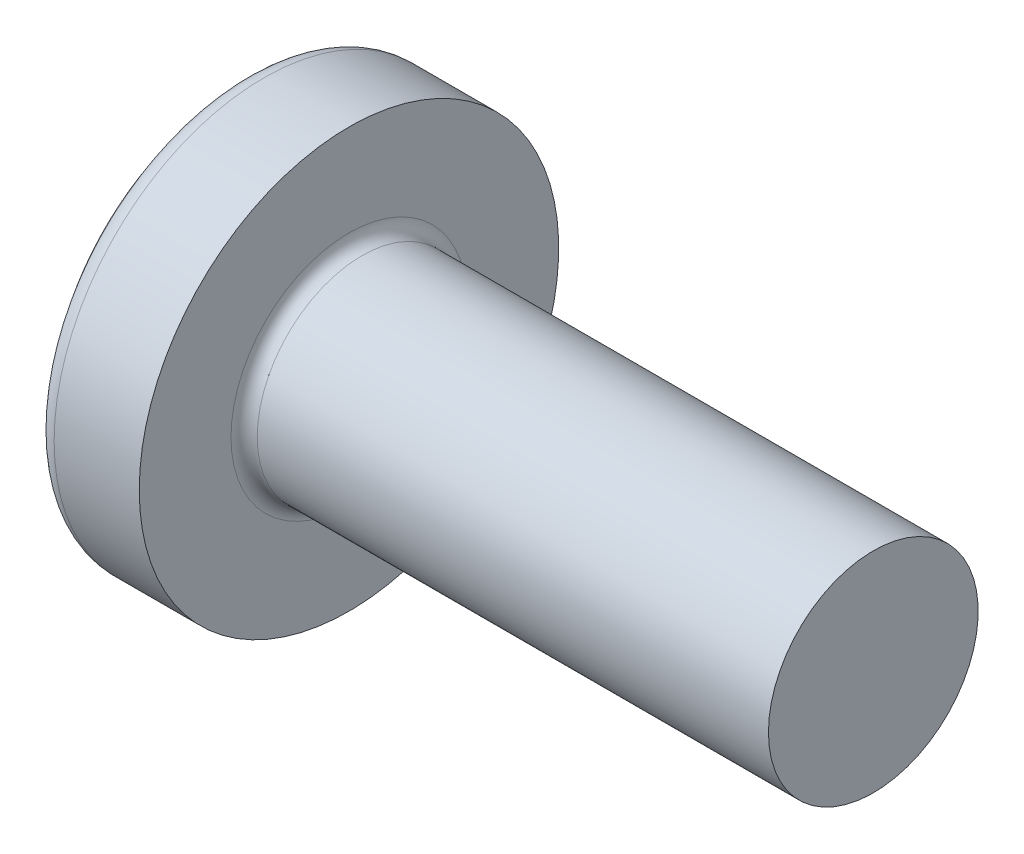
ISO-10303-21;
HEADER;
FILE_DESCRIPTION(('STEP AP214'),'2;1');
FILE_NAME('part.step','',(''),(''),'','','');
FILE_SCHEMA(('AUTOMOTIVE_DESIGN { 1 0 10303 214 1 1 1 1 }'));
ENDSEC;
DATA;
#1=APPLICATION_CONTEXT('core data for automotive mechanical design processes');
#2=APPLICATION_PROTOCOL_DEFINITION('international standard','automotive_design',2000,#1);
#3=PRODUCT_CONTEXT('',#1,'mechanical');
#4=PRODUCT('Part','Part','',(#3));
#5=PRODUCT_RELATED_PRODUCT_CATEGORY('part','',(#4));
#6=PRODUCT_DEFINITION_FORMATION('','',#4);
#7=PRODUCT_DEFINITION_CONTEXT('part definition',#1,'design');
#8=PRODUCT_DEFINITION('design','',#6,#7);
#9=PRODUCT_DEFINITION_SHAPE('','',#8);
#10=(LENGTH_UNIT() NAMED_UNIT(*) SI_UNIT(.MILLI.,.METRE.));
#11=(NAMED_UNIT(*) PLANE_ANGLE_UNIT() SI_UNIT($,.RADIAN.));
#12=(NAMED_UNIT(*) SI_UNIT($,.STERADIAN.) SOLID_ANGLE_UNIT());
#13=UNCERTAINTY_MEASURE_WITH_UNIT(LENGTH_MEASURE(1.E-05),#10,'distance_accuracy_value','');
#14=(GEOMETRIC_REPRESENTATION_CONTEXT(3) GLOBAL_UNCERTAINTY_ASSIGNED_CONTEXT((#13)) GLOBAL_UNIT_ASSIGNED_CONTEXT((#10,
#11,#12)) REPRESENTATION_CONTEXT('',''));
#15=CARTESIAN_POINT('',(0.,0.,0.));
#16=DIRECTION('',(0.,0.,1.));
#17=DIRECTION('',(1.,0.,0.));
#18=AXIS2_PLACEMENT_3D('',#15,#16,#17);
#19=CARTESIAN_POINT('',(2.5,0.,0.));
#20=DIRECTION('',(-1.,0.,0.));
#21=DIRECTION('',(0.,1.,0.));
#22=AXIS2_PLACEMENT_3D('',#19,#20,#21);
#23=SPHERICAL_SURFACE('',#22,2.5);
#24=CARTESIAN_POINT('',(0.532633828839689,0.,0.));
#25=DIRECTION('',(-1.,0.,0.));
#26=DIRECTION('',(0.,0.,1.));
#27=AXIS2_PLACEMENT_3D('',#24,#25,#26);
#28=CIRCLE('',#27,1.54255319148936);
#29=CARTESIAN_POINT('',(0.532633828839689,0.,1.54255319148936));
#30=VERTEX_POINT('',#29);
#31=EDGE_CURVE('E241',#30,#30,#28,.T.);
#32=ORIENTED_EDGE('',*,*,#31,.T.);
#33=EDGE_LOOP('',(#32));
#34=FACE_BOUND('',#33,.T.);
#35=CARTESIAN_POINT('',(0.0348536438778153,0.,0.));
#36=DIRECTION('',(1.,0.,0.));
#37=DIRECTION('',(0.,0.,-1.));
#38=AXIS2_PLACEMENT_3D('',#35,#36,#37);
#39=CIRCLE('',#38,0.415996926548163);
#40=CARTESIAN_POINT('',(0.0348536438778156,-0.239999999999999,-0.339784406495528));
#41=VERTEX_POINT('',#40);
#42=CARTESIAN_POINT('',(0.0348536438778153,-0.339784406495526,-0.24));
#43=VERTEX_POINT('',#42);
#44=EDGE_CURVE('E377',#41,#43,#39,.F.);
#45=ORIENTED_EDGE('',*,*,#44,.F.);
#46=CARTESIAN_POINT('',(2.5,-0.24,0.));
#47=DIRECTION('',(0.,1.,0.));
#48=DIRECTION('',(0.,0.,1.));
#49=AXIS2_PLACEMENT_3D('',#46,#47,#48);
#50=CIRCLE('',#49,2.48845333490504);
#51=CARTESIAN_POINT('',(0.12361367782094,-0.239999999999997,-0.738368504041365));
#52=VERTEX_POINT('',#51);
#53=EDGE_CURVE('E303',#52,#41,#50,.T.);
#54=ORIENTED_EDGE('',*,*,#53,.F.);
#55=CARTESIAN_POINT('',(2.32172308413752,0.,0.357568235162189));
#56=DIRECTION('',(0.446197753347436,0.,-0.894934391398443));
#57=DIRECTION('',(-0.894934391398443,0.,-0.446197753347436));
#58=AXIS2_PLACEMENT_3D('',#55,#56,#57);
#59=CIRCLE('',#58,2.46786594013402);
#60=CARTESIAN_POINT('',(0.12361367782094,0.240000000000003,-0.738368504041363));
#61=VERTEX_POINT('',#60);
#62=EDGE_CURVE('E275',#52,#61,#59,.T.);
#63=ORIENTED_EDGE('',*,*,#62,.T.);
#64=CARTESIAN_POINT('',(2.5,0.24,0.));
#65=DIRECTION('',(0.,-1.,0.));
#66=DIRECTION('',(0.,0.,-1.));
#67=AXIS2_PLACEMENT_3D('',#64,#65,#66);
#68=CIRCLE('',#67,2.48845333490504);
#69=CARTESIAN_POINT('',(0.0348536438778155,0.240000000000001,-0.339784406495526));
#70=VERTEX_POINT('',#69);
#71=EDGE_CURVE('E330',#70,#61,#68,.T.);
#72=ORIENTED_EDGE('',*,*,#71,.F.);
#73=CARTESIAN_POINT('',(0.0348536438778153,0.339784406495525,-0.24));
#74=VERTEX_POINT('',#73);
#75=EDGE_CURVE('E396',#74,#70,#39,.F.);
#76=ORIENTED_EDGE('',*,*,#75,.F.);
#77=CARTESIAN_POINT('',(2.5,0.,-0.24));
#78=DIRECTION('',(0.,0.,1.));
#79=DIRECTION('',(1.,0.,0.));
#80=AXIS2_PLACEMENT_3D('',#77,#78,#79);
#81=CIRCLE('',#80,2.48845333490504);
#82=CARTESIAN_POINT('',(0.12361367782094,0.738368504041364,-0.24));
#83=VERTEX_POINT('',#82);
#84=EDGE_CURVE('E269',#83,#74,#81,.T.);
#85=ORIENTED_EDGE('',*,*,#84,.F.);
#86=CARTESIAN_POINT('',(2.32172308413752,-0.357568235162189,0.));
#87=DIRECTION('',(0.446197753347436,0.894934391398443,0.));
#88=DIRECTION('',(-0.894934391398443,0.446197753347436,0.));
#89=AXIS2_PLACEMENT_3D('',#86,#87,#88);
#90=CIRCLE('',#89,2.46786594013402);
#91=CARTESIAN_POINT('',(0.12361367782094,0.738368504041364,0.24));
#92=VERTEX_POINT('',#91);
#93=EDGE_CURVE('E272',#83,#92,#90,.T.);
#94=ORIENTED_EDGE('',*,*,#93,.T.);
#95=CARTESIAN_POINT('',(2.5,0.,0.24));
#96=DIRECTION('',(0.,0.,-1.));
#97=DIRECTION('',(0.,1.,0.));
#98=AXIS2_PLACEMENT_3D('',#95,#96,#97);
#99=CIRCLE('',#98,2.48845333490504);
#100=CARTESIAN_POINT('',(0.0348536438778153,0.339784406495525,0.24));
#101=VERTEX_POINT('',#100);
#102=EDGE_CURVE('E265',#101,#92,#99,.T.);
#103=ORIENTED_EDGE('',*,*,#102,.F.);
#104=CARTESIAN_POINT('',(0.0348536438778156,0.239999999999999,0.339784406495528));
#105=VERTEX_POINT('',#104);
#106=EDGE_CURVE('E395',#105,#101,#39,.F.);
#107=ORIENTED_EDGE('',*,*,#106,.F.);
#108=CARTESIAN_POINT('',(0.12361367782094,0.239999999999997,0.738368504041365));
#109=VERTEX_POINT('',#108);
#110=EDGE_CURVE('E285',#109,#105,#68,.T.);
#111=ORIENTED_EDGE('',*,*,#110,.F.);
#112=CARTESIAN_POINT('',(2.32172308413752,0.,-0.357568235162189));
#113=DIRECTION('',(0.446197753347436,0.,0.894934391398443));
#114=DIRECTION('',(0.894934391398443,0.,-0.446197753347436));
#115=AXIS2_PLACEMENT_3D('',#112,#113,#114);
#116=CIRCLE('',#115,2.46786594013402);
#117=CARTESIAN_POINT('',(0.12361367782094,-0.240000000000002,0.738368504041363));
#118=VERTEX_POINT('',#117);
#119=EDGE_CURVE('E52',#109,#118,#116,.T.);
#120=ORIENTED_EDGE('',*,*,#119,.T.);
#121=CARTESIAN_POINT('',(0.0348536438778154,-0.240000000000001,0.339784406495526));
#122=VERTEX_POINT('',#121);
#123=EDGE_CURVE('E282',#122,#118,#50,.T.);
#124=ORIENTED_EDGE('',*,*,#123,.F.);
#125=CARTESIAN_POINT('',(0.0348536438778153,-0.339784406495526,0.24));
#126=VERTEX_POINT('',#125);
#127=EDGE_CURVE('E435',#126,#122,#39,.F.);
#128=ORIENTED_EDGE('',*,*,#127,.F.);
#129=CARTESIAN_POINT('',(0.12361367782094,-0.738368504041364,0.24));
#130=VERTEX_POINT('',#129);
#131=EDGE_CURVE('E266',#130,#126,#99,.T.);
#132=ORIENTED_EDGE('',*,*,#131,.F.);
#133=CARTESIAN_POINT('',(2.32172308413752,0.357568235162189,0.));
#134=DIRECTION('',(0.446197753347436,-0.894934391398443,0.));
#135=DIRECTION('',(0.894934391398443,0.446197753347436,0.));
#136=AXIS2_PLACEMENT_3D('',#133,#134,#135);
#137=CIRCLE('',#136,2.46786594013402);
#138=CARTESIAN_POINT('',(0.12361367782094,-0.738368504041364,-0.24));
#139=VERTEX_POINT('',#138);
#140=EDGE_CURVE('E262',#130,#139,#137,.T.);
#141=ORIENTED_EDGE('',*,*,#140,.T.);
#142=EDGE_CURVE('E67',#43,#139,#81,.T.);
#143=ORIENTED_EDGE('',*,*,#142,.F.);
#144=EDGE_LOOP('',(#45,#54,#63,#72,#76,#85,#94,#103,#107,#111,#120,#124,#128,#132,#141,#143));
#145=FACE_BOUND('',#144,.T.);
#146=ADVANCED_FACE('F38',(#34,#145),#23,.T.);
#147=CARTESIAN_POINT('',(0.,0.8,-0.24));
#148=DIRECTION('',(0.,0.,1.));
#149=DIRECTION('',(1.,0.,0.));
#150=AXIS2_PLACEMENT_3D('',#147,#148,#149);
#151=PLANE('',#150);
#152=ORIENTED_EDGE('',*,*,#84,.T.);
#153=CARTESIAN_POINT('',(-0.629305626090504,0.395285037112982,-0.24));
#154=CARTESIAN_POINT('',(-0.502245440869323,0.384885761504805,-0.24));
#155=CARTESIAN_POINT('',(-0.375193303991233,0.374386041200533,-0.24));
#156=CARTESIAN_POINT('',(-0.121109362358297,0.353102592236972,-0.24));
#157=CARTESIAN_POINT('',(0.00592244174753981,0.342318855839852,-0.24));
#158=CARTESIAN_POINT('',(0.259954553132912,0.320384813741064,-0.24));
#159=CARTESIAN_POINT('',(0.386954860411928,0.309234508033358,-0.24));
#160=CARTESIAN_POINT('',(0.640908035068628,0.286428502217992,-0.24));
#161=CARTESIAN_POINT('',(0.767860903211904,0.274772810656204,-0.24));
#162=CARTESIAN_POINT('',(1.02740505364566,0.25019581365541,-0.24));
#163=CARTESIAN_POINT('',(1.15999322223084,0.23724116727319,-0.24));
#164=CARTESIAN_POINT('',(1.35878055743683,0.216851377657761,-0.24));
#165=CARTESIAN_POINT('',(1.42502853887615,0.209894992147932,-0.24));
#166=CARTESIAN_POINT('',(1.55747716895954,0.195536747895868,-0.24));
#167=CARTESIAN_POINT('',(1.62367781680678,0.18813488182494,-0.24));
#168=CARTESIAN_POINT('',(1.68984631429487,0.180447253558898,-0.24));
#169=B_SPLINE_CURVE_WITH_KNOTS('',3,(#153,#154,#155,#156,#157,#158,#159,#160,#161,#162,#163,
#164,#165,#166,#167,#168),.UNSPECIFIED.,.F.,.F.,(4,2,2,2,2,2,2,4),(0.,0.382455333743982,
0.764921098031735,1.14738686861956,1.52984617438513,1.92950045825533,2.12933578679647,
2.32917440376968),.UNSPECIFIED.);
#170=CARTESIAN_POINT('',(0.9,0.262259890185289,-0.24));
#171=VERTEX_POINT('',#170);
#172=EDGE_CURVE('E419',#74,#171,#169,.T.);
#173=ORIENTED_EDGE('',*,*,#172,.T.);
#174=DIRECTION('',(0.,1.,0.));
#175=VECTOR('',#174,1.);
#176=CARTESIAN_POINT('',(0.9,-0.351276627792593,-0.24));
#177=LINE('',#176,#175);
#178=CARTESIAN_POINT('',(0.9,0.351276627792593,-0.24));
#179=VERTEX_POINT('',#178);
#180=EDGE_CURVE('E359',#171,#179,#177,.T.);
#181=ORIENTED_EDGE('',*,*,#180,.T.);
#182=DIRECTION('',(0.894934391398443,-0.446197753347436,0.));
#183=VECTOR('',#182,1.);
#184=CARTESIAN_POINT('',(0.,0.8,-0.24));
#185=LINE('',#184,#183);
#186=EDGE_CURVE('E242',#83,#179,#185,.T.);
#187=ORIENTED_EDGE('',*,*,#186,.F.);
#188=EDGE_LOOP('',(#152,#173,#181,#187));
#189=FACE_BOUND('',#188,.T.);
#190=ADVANCED_FACE('F197',(#189),#151,.T.);
#191=CARTESIAN_POINT('',(0.9,-0.351276627792593,-0.24));
#192=VERTEX_POINT('',#191);
#193=CARTESIAN_POINT('',(0.9,-0.262259890185289,-0.24));
#194=VERTEX_POINT('',#193);
#195=EDGE_CURVE('E250',#192,#194,#177,.T.);
#196=ORIENTED_EDGE('',*,*,#195,.T.);
#197=CARTESIAN_POINT('',(-0.629305626090504,-0.395285037112982,-0.24));
#198=CARTESIAN_POINT('',(-0.502245440869323,-0.384885761504805,-0.24));
#199=CARTESIAN_POINT('',(-0.375193303991233,-0.374386041200533,-0.24));
#200=CARTESIAN_POINT('',(-0.121109362358296,-0.353102592236972,-0.24));
#201=CARTESIAN_POINT('',(0.00592244174753997,-0.342318855839852,-0.24));
#202=CARTESIAN_POINT('',(0.259954553132912,-0.320384813741064,-0.24));
#203=CARTESIAN_POINT('',(0.386954860411928,-0.309234508033358,-0.24));
#204=CARTESIAN_POINT('',(0.640908035068629,-0.286428502217992,-0.24));
#205=CARTESIAN_POINT('',(0.767860903211904,-0.274772810656204,-0.24));
#206=CARTESIAN_POINT('',(1.02740505364565,-0.250195813655411,-0.24));
#207=CARTESIAN_POINT('',(1.15999322223082,-0.237241167273191,-0.24));
#208=CARTESIAN_POINT('',(1.35878055743681,-0.216851377657763,-0.24));
#209=CARTESIAN_POINT('',(1.42502853887612,-0.209894992147935,-0.24));
#210=CARTESIAN_POINT('',(1.55747716895951,-0.195536747895872,-0.24));
#211=CARTESIAN_POINT('',(1.62367781680675,-0.188134881824944,-0.24));
#212=CARTESIAN_POINT('',(1.68984631429483,-0.180447253558903,-0.24));
#213=B_SPLINE_CURVE_WITH_KNOTS('',3,(#197,#198,#199,#200,#201,#202,#203,#204,#205,#206,#207,
#208,#209,#210,#211,#212),.UNSPECIFIED.,.F.,.F.,(4,2,2,2,2,2,2,4),(0.,0.382455333743982,
0.764921098031735,1.14738686861956,1.52984617438513,1.92950045825531,2.12933578679643,
2.32917440376964),.UNSPECIFIED.);
#214=EDGE_CURVE('E394',#194,#43,#213,.F.);
#215=ORIENTED_EDGE('',*,*,#214,.T.);
#216=ORIENTED_EDGE('',*,*,#142,.T.);
#217=DIRECTION('',(0.894934391398443,0.446197753347436,0.));
#218=VECTOR('',#217,1.);
#219=CARTESIAN_POINT('',(0.,-0.8,-0.24));
#220=LINE('',#219,#218);
#221=EDGE_CURVE('E333',#139,#192,#220,.T.);
#222=ORIENTED_EDGE('',*,*,#221,.T.);
#223=EDGE_LOOP('',(#196,#215,#216,#222));
#224=FACE_BOUND('',#223,.T.);
#225=ADVANCED_FACE('F203',(#224),#151,.T.);
#226=CARTESIAN_POINT('',(0.,-0.799999999999999,0.24));
#227=DIRECTION('',(0.,0.,-1.));
#228=DIRECTION('',(0.,1.,0.));
#229=AXIS2_PLACEMENT_3D('',#226,#227,#228);
#230=PLANE('',#229);
#231=DIRECTION('',(0.,-1.,0.));
#232=VECTOR('',#231,1.);
#233=CARTESIAN_POINT('',(0.9,0.351276627792594,0.24));
#234=LINE('',#233,#232);
#235=CARTESIAN_POINT('',(0.9,0.351276627792593,0.24));
#236=VERTEX_POINT('',#235);
#237=CARTESIAN_POINT('',(0.9,0.262259890185289,0.24));
#238=VERTEX_POINT('',#237);
#239=EDGE_CURVE('E342',#236,#238,#234,.T.);
#240=ORIENTED_EDGE('',*,*,#239,.T.);
#241=CARTESIAN_POINT('',(-0.629305630567792,0.395285037479254,0.24));
#242=CARTESIAN_POINT('',(-0.502245444906562,0.384885761837513,0.24));
#243=CARTESIAN_POINT('',(-0.37519330758842,0.374386041499476,0.24));
#244=CARTESIAN_POINT('',(-0.121109365075988,0.353102592467066,0.24));
#245=CARTESIAN_POINT('',(0.00592243946929239,0.342318856034865,0.24));
#246=CARTESIAN_POINT('',(0.259954552394605,0.320384813806507,0.24));
#247=CARTESIAN_POINT('',(0.386954860773954,0.309234508002403,0.24));
#248=CARTESIAN_POINT('',(0.640908037631127,0.28642850198631,0.24));
#249=CARTESIAN_POINT('',(0.767860906874543,0.274772810320191,0.24));
#250=CARTESIAN_POINT('',(1.02740503497565,0.250195815411899,0.24));
#251=CARTESIAN_POINT('',(1.15999318014164,0.237241171372315,0.24));
#252=CARTESIAN_POINT('',(1.35878048026026,0.216851385682782,0.24));
#253=CARTESIAN_POINT('',(1.42502845000982,0.209895001550346,0.24));
#254=CARTESIAN_POINT('',(1.55747705673949,0.195536760284768,0.24));
#255=CARTESIAN_POINT('',(1.62367769292276,0.188134895822942,0.24));
#256=CARTESIAN_POINT('',(1.68984617876648,0.180447269328966,0.24));
#257=B_SPLINE_CURVE_WITH_KNOTS('',3,(#241,#242,#243,#244,#245,#246,#247,#248,#249,#250,#251,
#252,#253,#254,#255,#256),.UNSPECIFIED.,.F.,.F.,(4,2,2,2,2,2,2,4),(0.,0.382455335067977,
0.764921100678223,1.14738687457974,1.52984618366023,1.92950039692501,2.12933569015818,
2.32917427182042),.UNSPECIFIED.);
#258=EDGE_CURVE('E674',#238,#101,#257,.F.);
#259=ORIENTED_EDGE('',*,*,#258,.T.);
#260=ORIENTED_EDGE('',*,*,#102,.T.);
#261=DIRECTION('',(0.894934391398443,-0.446197753347436,0.));
#262=VECTOR('',#261,1.);
#263=CARTESIAN_POINT('',(0.,0.8,0.24));
#264=LINE('',#263,#262);
#265=EDGE_CURVE('E247',#92,#236,#264,.T.);
#266=ORIENTED_EDGE('',*,*,#265,.T.);
#267=EDGE_LOOP('',(#240,#259,#260,#266));
#268=FACE_BOUND('',#267,.T.);
#269=ADVANCED_FACE('F415',(#268),#230,.T.);
#270=ORIENTED_EDGE('',*,*,#131,.T.);
#271=CARTESIAN_POINT('',(-0.629305630567792,-0.395285037479254,0.24));
#272=CARTESIAN_POINT('',(-0.502245444906562,-0.384885761837513,0.24));
#273=CARTESIAN_POINT('',(-0.37519330758842,-0.374386041499476,0.24));
#274=CARTESIAN_POINT('',(-0.121109365075988,-0.353102592467066,0.24));
#275=CARTESIAN_POINT('',(0.00592243946929239,-0.342318856034865,0.24));
#276=CARTESIAN_POINT('',(0.259954552394605,-0.320384813806507,0.24));
#277=CARTESIAN_POINT('',(0.386954860773954,-0.309234508002403,0.24));
#278=CARTESIAN_POINT('',(0.640908037631127,-0.28642850198631,0.24));
#279=CARTESIAN_POINT('',(0.767860906874543,-0.274772810320191,0.24));
#280=CARTESIAN_POINT('',(1.02740503497565,-0.250195815411899,0.24));
#281=CARTESIAN_POINT('',(1.15999318014165,-0.237241171372315,0.24));
#282=CARTESIAN_POINT('',(1.35878048026027,-0.216851385682782,0.24));
#283=CARTESIAN_POINT('',(1.42502845000983,-0.209895001550345,0.24));
#284=CARTESIAN_POINT('',(1.55747705673949,-0.195536760284768,0.24));
#285=CARTESIAN_POINT('',(1.62367769292277,-0.188134895822941,0.24));
#286=CARTESIAN_POINT('',(1.68984617876649,-0.180447269328966,0.24));
#287=B_SPLINE_CURVE_WITH_KNOTS('',3,(#271,#272,#273,#274,#275,#276,#277,#278,#279,#280,#281,
#282,#283,#284,#285,#286),.UNSPECIFIED.,.F.,.F.,(4,2,2,2,2,2,2,4),(0.,0.382455335067977,
0.764921100678223,1.14738687457974,1.52984618366023,1.92950039692501,2.12933569015818,
2.32917427182042),.UNSPECIFIED.);
#288=CARTESIAN_POINT('',(0.9,-0.262259890185289,0.24));
#289=VERTEX_POINT('',#288);
#290=EDGE_CURVE('E436',#126,#289,#287,.T.);
#291=ORIENTED_EDGE('',*,*,#290,.T.);
#292=CARTESIAN_POINT('',(0.9,-0.351276627792593,0.24));
#293=VERTEX_POINT('',#292);
#294=EDGE_CURVE('E344',#289,#293,#234,.T.);
#295=ORIENTED_EDGE('',*,*,#294,.T.);
#296=DIRECTION('',(0.894934391398443,0.446197753347436,0.));
#297=VECTOR('',#296,1.);
#298=CARTESIAN_POINT('',(0.,-0.8,0.24));
#299=LINE('',#298,#297);
#300=EDGE_CURVE('E335',#130,#293,#299,.T.);
#301=ORIENTED_EDGE('',*,*,#300,.F.);
#302=EDGE_LOOP('',(#270,#291,#295,#301));
#303=FACE_BOUND('',#302,.T.);
#304=ADVANCED_FACE('F522',(#303),#230,.T.);
#305=CARTESIAN_POINT('',(0.9,0.351276627792594,0.24));
#306=DIRECTION('',(0.446197753347436,0.894934391398443,0.));
#307=DIRECTION('',(-0.894934391398443,0.446197753347436,0.));
#308=AXIS2_PLACEMENT_3D('',#305,#306,#307);
#309=PLANE('',#308);
#310=CARTESIAN_POINT('',(1.51667990224654,0.0438114218941496,0.));
#311=DIRECTION('',(0.446197753347436,0.894934391398443,0.));
#312=DIRECTION('',(-0.894934391398443,0.446197753347436,0.));
#313=AXIS2_PLACEMENT_3D('',#310,#311,#312);
#314=ELLIPSE('',#313,0.700087658673246,0.309289972496479);
#315=CARTESIAN_POINT('',(0.9,0.351276627792594,0.0546349775021752));
#316=VERTEX_POINT('',#315);
#317=CARTESIAN_POINT('',(0.9,0.351276627792594,-0.0546349775021753));
#318=VERTEX_POINT('',#317);
#319=EDGE_CURVE('E308',#316,#318,#314,.F.);
#320=ORIENTED_EDGE('',*,*,#319,.F.);
#321=DIRECTION('',(0.,0.,-1.));
#322=VECTOR('',#321,1.);
#323=CARTESIAN_POINT('',(0.9,0.351276627792594,0.24));
#324=LINE('',#323,#322);
#325=EDGE_CURVE('E345',#236,#316,#324,.T.);
#326=ORIENTED_EDGE('',*,*,#325,.F.);
#327=ORIENTED_EDGE('',*,*,#265,.F.);
#328=ORIENTED_EDGE('',*,*,#93,.F.);
#329=ORIENTED_EDGE('',*,*,#186,.T.);
#330=EDGE_CURVE('E347',#318,#179,#324,.T.);
#331=ORIENTED_EDGE('',*,*,#330,.F.);
#332=EDGE_LOOP('',(#320,#326,#327,#328,#329,#331));
#333=FACE_BOUND('',#332,.T.);
#334=ADVANCED_FACE('F413',(#333),#309,.F.);
#335=CARTESIAN_POINT('',(0.9,-0.351276627792593,-0.24));
#336=DIRECTION('',(0.446197753347436,-0.894934391398443,0.));
#337=DIRECTION('',(0.894934391398443,0.446197753347436,0.));
#338=AXIS2_PLACEMENT_3D('',#335,#336,#337);
#339=PLANE('',#338);
#340=CARTESIAN_POINT('',(1.51667990224654,-0.0438114218941494,0.));
#341=DIRECTION('',(0.446197753347436,-0.894934391398443,0.));
#342=DIRECTION('',(-0.894934391398443,-0.446197753347436,0.));
#343=AXIS2_PLACEMENT_3D('',#340,#341,#342);
#344=ELLIPSE('',#343,0.700087658673246,0.30928997249648);
#345=CARTESIAN_POINT('',(0.9,-0.351276627792594,-0.054634977502177));
#346=VERTEX_POINT('',#345);
#347=CARTESIAN_POINT('',(0.9,-0.351276627792594,0.0546349775021769));
#348=VERTEX_POINT('',#347);
#349=EDGE_CURVE('E676',#346,#348,#344,.F.);
#350=ORIENTED_EDGE('',*,*,#349,.F.);
#351=DIRECTION('',(0.,0.,1.));
#352=VECTOR('',#351,1.);
#353=CARTESIAN_POINT('',(0.9,-0.351276627792593,-0.24));
#354=LINE('',#353,#352);
#355=EDGE_CURVE('E338',#192,#346,#354,.T.);
#356=ORIENTED_EDGE('',*,*,#355,.F.);
#357=ORIENTED_EDGE('',*,*,#221,.F.);
#358=ORIENTED_EDGE('',*,*,#140,.F.);
#359=ORIENTED_EDGE('',*,*,#300,.T.);
#360=EDGE_CURVE('E341',#348,#293,#354,.T.);
#361=ORIENTED_EDGE('',*,*,#360,.F.);
#362=EDGE_LOOP('',(#350,#356,#357,#358,#359,#361));
#363=FACE_BOUND('',#362,.T.);
#364=ADVANCED_FACE('F509',(#363),#339,.F.);
#365=CARTESIAN_POINT('',(0.9,0.351276627792593,-0.24));
#366=DIRECTION('',(-1.,0.,0.));
#367=DIRECTION('',(0.,0.,1.));
#368=AXIS2_PLACEMENT_3D('',#365,#366,#367);
#369=PLANE('',#368);
#370=DIRECTION('',(0.,1.,0.));
#371=VECTOR('',#370,1.);
#372=CARTESIAN_POINT('',(0.9,-0.240000000000001,0.351276627792593));
#373=LINE('',#372,#371);
#374=CARTESIAN_POINT('',(0.9,-0.240000000000001,0.351276627792593));
#375=VERTEX_POINT('',#374);
#376=CARTESIAN_POINT('',(0.9,-0.0546349775021802,0.351276627792593));
#377=VERTEX_POINT('',#376);
#378=EDGE_CURVE('E323',#375,#377,#373,.T.);
#379=ORIENTED_EDGE('',*,*,#378,.T.);
#380=CARTESIAN_POINT('',(0.9,0.,0.));
#381=DIRECTION('',(-1.,0.,0.));
#382=DIRECTION('',(0.,0.,1.));
#383=AXIS2_PLACEMENT_3D('',#380,#381,#382);
#384=CIRCLE('',#383,0.3555);
#385=CARTESIAN_POINT('',(0.9,-0.240000000000001,0.262259890185289));
#386=VERTEX_POINT('',#385);
#387=EDGE_CURVE('E704',#386,#377,#384,.T.);
#388=ORIENTED_EDGE('',*,*,#387,.F.);
#389=DIRECTION('',(0.,0.,-1.));
#390=VECTOR('',#389,1.);
#391=CARTESIAN_POINT('',(0.9,-0.240000000000001,0.351276627792593));
#392=LINE('',#391,#390);
#393=EDGE_CURVE('E319',#375,#386,#392,.T.);
#394=ORIENTED_EDGE('',*,*,#393,.F.);
#395=EDGE_LOOP('',(#379,#388,#394));
#396=FACE_BOUND('',#395,.T.);
#397=ADVANCED_FACE('F502',(#396),#369,.T.);
#398=ORIENTED_EDGE('',*,*,#294,.F.);
#399=EDGE_CURVE('E709',#348,#289,#384,.T.);
#400=ORIENTED_EDGE('',*,*,#399,.F.);
#401=ORIENTED_EDGE('',*,*,#360,.T.);
#402=EDGE_LOOP('',(#398,#400,#401));
#403=FACE_BOUND('',#402,.T.);
#404=ADVANCED_FACE('F495',(#403),#369,.T.);
#405=ORIENTED_EDGE('',*,*,#355,.T.);
#406=EDGE_CURVE('E388',#194,#346,#384,.T.);
#407=ORIENTED_EDGE('',*,*,#406,.F.);
#408=ORIENTED_EDGE('',*,*,#195,.F.);
#409=EDGE_LOOP('',(#405,#407,#408));
#410=FACE_BOUND('',#409,.T.);
#411=ADVANCED_FACE('F489',(#410),#369,.T.);
#412=CARTESIAN_POINT('',(0.9,-0.239999999999999,-0.262259890185289));
#413=VERTEX_POINT('',#412);
#414=CARTESIAN_POINT('',(0.9,-0.239999999999999,-0.351276627792594));
#415=VERTEX_POINT('',#414);
#416=EDGE_CURVE('E322',#413,#415,#392,.T.);
#417=ORIENTED_EDGE('',*,*,#416,.F.);
#418=CARTESIAN_POINT('',(0.9,-0.0546349775021794,-0.351276627792594));
#419=VERTEX_POINT('',#418);
#420=EDGE_CURVE('E59',#419,#413,#384,.T.);
#421=ORIENTED_EDGE('',*,*,#420,.F.);
#422=DIRECTION('',(0.,-1.,0.));
#423=VECTOR('',#422,1.);
#424=CARTESIAN_POINT('',(0.9,0.240000000000001,-0.351276627792592));
#425=LINE('',#424,#423);
#426=EDGE_CURVE('E318',#419,#415,#425,.T.);
#427=ORIENTED_EDGE('',*,*,#426,.T.);
#428=EDGE_LOOP('',(#417,#421,#427));
#429=FACE_BOUND('',#428,.T.);
#430=ADVANCED_FACE('F383',(#429),#369,.T.);
#431=CARTESIAN_POINT('',(0.9,0.240000000000001,-0.351276627792592));
#432=VERTEX_POINT('',#431);
#433=CARTESIAN_POINT('',(0.9,0.054634977502182,-0.351276627792593));
#434=VERTEX_POINT('',#433);
#435=EDGE_CURVE('E315',#432,#434,#425,.T.);
#436=ORIENTED_EDGE('',*,*,#435,.T.);
#437=CARTESIAN_POINT('',(0.9,0.240000000000001,-0.262259890185289));
#438=VERTEX_POINT('',#437);
#439=EDGE_CURVE('E387',#438,#434,#384,.T.);
#440=ORIENTED_EDGE('',*,*,#439,.F.);
#441=DIRECTION('',(0.,0.,1.));
#442=VECTOR('',#441,1.);
#443=CARTESIAN_POINT('',(0.9,0.240000000000001,-0.351276627792592));
#444=LINE('',#443,#442);
#445=EDGE_CURVE('E327',#432,#438,#444,.T.);
#446=ORIENTED_EDGE('',*,*,#445,.F.);
#447=EDGE_LOOP('',(#436,#440,#446));
#448=FACE_BOUND('',#447,.T.);
#449=ADVANCED_FACE('F477',(#448),#369,.T.);
#450=ORIENTED_EDGE('',*,*,#180,.F.);
#451=EDGE_CURVE('E693',#318,#171,#384,.T.);
#452=ORIENTED_EDGE('',*,*,#451,.F.);
#453=ORIENTED_EDGE('',*,*,#330,.T.);
#454=EDGE_LOOP('',(#450,#452,#453));
#455=FACE_BOUND('',#454,.T.);
#456=ADVANCED_FACE('F470',(#455),#369,.T.);
#457=ORIENTED_EDGE('',*,*,#325,.T.);
#458=EDGE_CURVE('E695',#238,#316,#384,.T.);
#459=ORIENTED_EDGE('',*,*,#458,.F.);
#460=ORIENTED_EDGE('',*,*,#239,.F.);
#461=EDGE_LOOP('',(#457,#459,#460));
#462=FACE_BOUND('',#461,.T.);
#463=ADVANCED_FACE('F464',(#462),#369,.T.);
#464=CARTESIAN_POINT('',(0.,0.239999999999997,0.8));
#465=DIRECTION('',(0.,-1.,0.));
#466=DIRECTION('',(1.,0.,0.));
#467=AXIS2_PLACEMENT_3D('',#464,#465,#466);
#468=PLANE('',#467);
#469=ORIENTED_EDGE('',*,*,#110,.T.);
#470=CARTESIAN_POINT('',(-0.629305626090504,0.239999999999999,0.395285037112982));
#471=CARTESIAN_POINT('',(-0.502245440869323,0.239999999999999,0.384885761504806));
#472=CARTESIAN_POINT('',(-0.375193303991233,0.239999999999999,0.374386041200533));
#473=CARTESIAN_POINT('',(-0.121109362358296,0.239999999999999,0.353102592236972));
#474=CARTESIAN_POINT('',(0.00592244174753997,0.239999999999999,0.342318855839852));
#475=CARTESIAN_POINT('',(0.259954553132912,0.239999999999999,0.320384813741065));
#476=CARTESIAN_POINT('',(0.386954860411928,0.239999999999999,0.309234508033359));
#477=CARTESIAN_POINT('',(0.640908035068629,0.239999999999999,0.286428502217993));
#478=CARTESIAN_POINT('',(0.767860903211904,0.239999999999999,0.274772810656205));
#479=CARTESIAN_POINT('',(1.02740505364566,0.239999999999999,0.250195813655411));
#480=CARTESIAN_POINT('',(1.15999322223084,0.239999999999999,0.237241167273191));
#481=CARTESIAN_POINT('',(1.35878055743683,0.239999999999999,0.216851377657762));
#482=CARTESIAN_POINT('',(1.42502853887615,0.239999999999999,0.209894992147933));
#483=CARTESIAN_POINT('',(1.55747716895955,0.239999999999999,0.195536747895869));
#484=CARTESIAN_POINT('',(1.62367781680678,0.239999999999999,0.188134881824941));
#485=CARTESIAN_POINT('',(1.68984631429487,0.239999999999999,0.180447253558899));
#486=B_SPLINE_CURVE_WITH_KNOTS('',3,(#470,#471,#472,#473,#474,#475,#476,#477,#478,#479,#480,
#481,#482,#483,#484,#485),.UNSPECIFIED.,.F.,.F.,(4,2,2,2,2,2,2,4),(0.,0.382455333743982,
0.764921098031735,1.14738686861956,1.52984617438513,1.92950045825533,2.12933578679647,
2.32917440376968),.UNSPECIFIED.);
#487=CARTESIAN_POINT('',(0.9,0.239999999999999,0.26225989018529));
#488=VERTEX_POINT('',#487);
#489=EDGE_CURVE('E673',#105,#488,#486,.T.);
#490=ORIENTED_EDGE('',*,*,#489,.T.);
#491=CARTESIAN_POINT('',(0.9,0.239999999999999,0.351276627792594));
#492=VERTEX_POINT('',#491);
#493=EDGE_CURVE('E300',#488,#492,#444,.T.);
#494=ORIENTED_EDGE('',*,*,#493,.T.);
#495=DIRECTION('',(0.894934391398443,0.,-0.446197753347436));
#496=VECTOR('',#495,1.);
#497=CARTESIAN_POINT('',(0.,0.239999999999997,0.800000000000001));
#498=LINE('',#497,#496);
#499=EDGE_CURVE('E293',#109,#492,#498,.T.);
#500=ORIENTED_EDGE('',*,*,#499,.F.);
#501=EDGE_LOOP('',(#469,#490,#494,#500));
#502=FACE_BOUND('',#501,.T.);
#503=ADVANCED_FACE('F297',(#502),#468,.T.);
#504=CARTESIAN_POINT('',(0.,-0.239999999999997,-0.8));
#505=DIRECTION('',(0.,1.,0.));
#506=DIRECTION('',(0.,0.,1.));
#507=AXIS2_PLACEMENT_3D('',#504,#505,#506);
#508=PLANE('',#507);
#509=ORIENTED_EDGE('',*,*,#393,.T.);
#510=CARTESIAN_POINT('',(-0.629305630567792,-0.240000000000001,0.395285037479253));
#511=CARTESIAN_POINT('',(-0.502245444906562,-0.240000000000001,0.384885761837512));
#512=CARTESIAN_POINT('',(-0.375193307588421,-0.240000000000001,0.374386041499475));
#513=CARTESIAN_POINT('',(-0.121109365075988,-0.240000000000001,0.353102592467065));
#514=CARTESIAN_POINT('',(0.00592243946929229,-0.240000000000001,0.342318856034864));
#515=CARTESIAN_POINT('',(0.259954552394605,-0.240000000000001,0.320384813806506));
#516=CARTESIAN_POINT('',(0.386954860773954,-0.240000000000001,0.309234508002402));
#517=CARTESIAN_POINT('',(0.640908037631128,-0.240000000000001,0.286428501986309));
#518=CARTESIAN_POINT('',(0.767860906874543,-0.240000000000001,0.27477281032019));
#519=CARTESIAN_POINT('',(1.02740503497565,-0.240000000000001,0.250195815411898));
#520=CARTESIAN_POINT('',(1.15999318014165,-0.240000000000001,0.237241171372314));
#521=CARTESIAN_POINT('',(1.35878048026027,-0.240000000000001,0.216851385682781));
#522=CARTESIAN_POINT('',(1.42502845000983,-0.240000000000001,0.209895001550344));
#523=CARTESIAN_POINT('',(1.5574770567395,-0.240000000000001,0.195536760284766));
#524=CARTESIAN_POINT('',(1.62367769292277,-0.240000000000001,0.18813489582294));
#525=CARTESIAN_POINT('',(1.68984617876649,-0.240000000000001,0.180447269328964));
#526=B_SPLINE_CURVE_WITH_KNOTS('',3,(#510,#511,#512,#513,#514,#515,#516,#517,#518,#519,#520,
#521,#522,#523,#524,#525),.UNSPECIFIED.,.F.,.F.,(4,2,2,2,2,2,2,4),(0.,0.382455335067977,
0.764921100678223,1.14738687457974,1.52984618366023,1.92950039692502,2.12933569015819,
2.32917427182043),.UNSPECIFIED.);
#527=EDGE_CURVE('E428',#386,#122,#526,.F.);
#528=ORIENTED_EDGE('',*,*,#527,.T.);
#529=ORIENTED_EDGE('',*,*,#123,.T.);
#530=DIRECTION('',(0.894934391398443,0.,-0.446197753347436));
#531=VECTOR('',#530,1.);
#532=CARTESIAN_POINT('',(0.,-0.240000000000003,0.799999999999999));
#533=LINE('',#532,#531);
#534=EDGE_CURVE('E295',#118,#375,#533,.T.);
#535=ORIENTED_EDGE('',*,*,#534,.T.);
#536=EDGE_LOOP('',(#509,#528,#529,#535));
#537=FACE_BOUND('',#536,.T.);
#538=ADVANCED_FACE('F232',(#537),#508,.T.);
#539=CARTESIAN_POINT('',(0.9,-0.240000000000001,0.351276627792593));
#540=DIRECTION('',(0.446197753347436,0.,0.894934391398443));
#541=DIRECTION('',(-0.894934391398443,0.,0.446197753347436));
#542=AXIS2_PLACEMENT_3D('',#539,#540,#541);
#543=PLANE('',#542);
#544=CARTESIAN_POINT('',(1.51667990224654,0.,0.0438114218941495));
#545=DIRECTION('',(0.446197753347436,0.,0.894934391398443));
#546=DIRECTION('',(-0.894934391398443,0.,0.446197753347436));
#547=AXIS2_PLACEMENT_3D('',#544,#545,#546);
#548=ELLIPSE('',#547,0.700087658673246,0.30928997249648);
#549=CARTESIAN_POINT('',(0.9,0.0546349775021778,0.351276627792594));
#550=VERTEX_POINT('',#549);
#551=EDGE_CURVE('E426',#377,#550,#548,.F.);
#552=ORIENTED_EDGE('',*,*,#551,.F.);
#553=ORIENTED_EDGE('',*,*,#378,.F.);
#554=ORIENTED_EDGE('',*,*,#534,.F.);
#555=ORIENTED_EDGE('',*,*,#119,.F.);
#556=ORIENTED_EDGE('',*,*,#499,.T.);
#557=EDGE_CURVE('E326',#550,#492,#373,.T.);
#558=ORIENTED_EDGE('',*,*,#557,.F.);
#559=EDGE_LOOP('',(#552,#553,#554,#555,#556,#558));
#560=FACE_BOUND('',#559,.T.);
#561=ADVANCED_FACE('F291',(#560),#543,.F.);
#562=CARTESIAN_POINT('',(0.9,0.240000000000001,-0.351276627792592));
#563=DIRECTION('',(0.446197753347436,0.,-0.894934391398443));
#564=DIRECTION('',(0.894934391398443,0.,0.446197753347436));
#565=AXIS2_PLACEMENT_3D('',#562,#563,#564);
#566=PLANE('',#565);
#567=CARTESIAN_POINT('',(1.51667990224654,0.,-0.0438114218941494));
#568=DIRECTION('',(0.446197753347436,0.,-0.894934391398443));
#569=DIRECTION('',(-0.894934391398443,0.,-0.446197753347436));
#570=AXIS2_PLACEMENT_3D('',#567,#568,#569);
#571=ELLIPSE('',#570,0.700087658673246,0.30928997249648);
#572=EDGE_CURVE('E381',#434,#419,#571,.F.);
#573=ORIENTED_EDGE('',*,*,#572,.F.);
#574=ORIENTED_EDGE('',*,*,#435,.F.);
#575=DIRECTION('',(0.894934391398443,0.,0.446197753347436));
#576=VECTOR('',#575,1.);
#577=CARTESIAN_POINT('',(0.,0.240000000000003,-0.799999999999999));
#578=LINE('',#577,#576);
#579=EDGE_CURVE('E305',#61,#432,#578,.T.);
#580=ORIENTED_EDGE('',*,*,#579,.F.);
#581=ORIENTED_EDGE('',*,*,#62,.F.);
#582=DIRECTION('',(0.894934391398443,0.,0.446197753347436));
#583=VECTOR('',#582,1.);
#584=CARTESIAN_POINT('',(0.,-0.239999999999997,-0.800000000000001));
#585=LINE('',#584,#583);
#586=EDGE_CURVE('E312',#52,#415,#585,.T.);
#587=ORIENTED_EDGE('',*,*,#586,.T.);
#588=ORIENTED_EDGE('',*,*,#426,.F.);
#589=EDGE_LOOP('',(#573,#574,#580,#581,#587,#588));
#590=FACE_BOUND('',#589,.T.);
#591=ADVANCED_FACE('F372',(#590),#566,.F.);
#592=ORIENTED_EDGE('',*,*,#445,.T.);
#593=CARTESIAN_POINT('',(-0.629305630567792,0.240000000000001,-0.395285037479253));
#594=CARTESIAN_POINT('',(-0.502245444906562,0.240000000000001,-0.384885761837512));
#595=CARTESIAN_POINT('',(-0.37519330758842,0.240000000000001,-0.374386041499475));
#596=CARTESIAN_POINT('',(-0.121109365075988,0.240000000000001,-0.353102592467065));
#597=CARTESIAN_POINT('',(0.00592243946929239,0.240000000000001,-0.342318856034864));
#598=CARTESIAN_POINT('',(0.259954552394605,0.240000000000001,-0.320384813806506));
#599=CARTESIAN_POINT('',(0.386954860773954,0.240000000000001,-0.309234508002402));
#600=CARTESIAN_POINT('',(0.640908037631127,0.240000000000001,-0.286428501986309));
#601=CARTESIAN_POINT('',(0.767860906874543,0.240000000000001,-0.27477281032019));
#602=CARTESIAN_POINT('',(1.02740503497566,0.240000000000001,-0.250195815411898));
#603=CARTESIAN_POINT('',(1.15999318014166,0.240000000000001,-0.237241171372313));
#604=CARTESIAN_POINT('',(1.35878048026028,0.240000000000001,-0.216851385682779));
#605=CARTESIAN_POINT('',(1.42502845000985,0.240000000000001,-0.209895001550342));
#606=CARTESIAN_POINT('',(1.55747705673952,0.240000000000001,-0.195536760284764));
#607=CARTESIAN_POINT('',(1.6236776929228,0.240000000000001,-0.188134895822937));
#608=CARTESIAN_POINT('',(1.68984617876652,0.240000000000001,-0.180447269328961));
#609=B_SPLINE_CURVE_WITH_KNOTS('',3,(#593,#594,#595,#596,#597,#598,#599,#600,#601,#602,#603,
#604,#605,#606,#607,#608),.UNSPECIFIED.,.F.,.F.,(4,2,2,2,2,2,2,4),(0.,0.382455335067977,
0.764921100678223,1.14738687457974,1.52984618366023,1.92950039692503,2.12933569015821,
2.32917427182045),.UNSPECIFIED.);
#610=EDGE_CURVE('E368',#438,#70,#609,.F.);
#611=ORIENTED_EDGE('',*,*,#610,.T.);
#612=ORIENTED_EDGE('',*,*,#71,.T.);
#613=ORIENTED_EDGE('',*,*,#579,.T.);
#614=EDGE_LOOP('',(#592,#611,#612,#613));
#615=FACE_BOUND('',#614,.T.);
#616=ADVANCED_FACE('F230',(#615),#468,.T.);
#617=ORIENTED_EDGE('',*,*,#53,.T.);
#618=CARTESIAN_POINT('',(-0.629305626090504,-0.239999999999998,-0.395285037112983));
#619=CARTESIAN_POINT('',(-0.502245440869323,-0.239999999999998,-0.384885761504806));
#620=CARTESIAN_POINT('',(-0.375193303991233,-0.239999999999998,-0.374386041200534));
#621=CARTESIAN_POINT('',(-0.121109362358297,-0.239999999999999,-0.353102592236972));
#622=CARTESIAN_POINT('',(0.00592244174753992,-0.239999999999999,-0.342318855839853));
#623=CARTESIAN_POINT('',(0.259954553132912,-0.239999999999999,-0.320384813741065));
#624=CARTESIAN_POINT('',(0.386954860411928,-0.239999999999999,-0.309234508033359));
#625=CARTESIAN_POINT('',(0.640908035068629,-0.239999999999999,-0.286428502217993));
#626=CARTESIAN_POINT('',(0.767860903211904,-0.239999999999999,-0.274772810656205));
#627=CARTESIAN_POINT('',(1.02740505364565,-0.239999999999999,-0.250195813655411));
#628=CARTESIAN_POINT('',(1.15999322223083,-0.239999999999999,-0.237241167273192));
#629=CARTESIAN_POINT('',(1.35878055743681,-0.239999999999999,-0.216851377657764));
#630=CARTESIAN_POINT('',(1.42502853887613,-0.239999999999999,-0.209894992147935));
#631=CARTESIAN_POINT('',(1.55747716895952,-0.239999999999999,-0.195536747895873));
#632=CARTESIAN_POINT('',(1.62367781680675,-0.239999999999999,-0.188134881824944));
#633=CARTESIAN_POINT('',(1.68984631429483,-0.239999999999999,-0.180447253558903));
#634=B_SPLINE_CURVE_WITH_KNOTS('',3,(#618,#619,#620,#621,#622,#623,#624,#625,#626,#627,#628,
#629,#630,#631,#632,#633),.UNSPECIFIED.,.F.,.F.,(4,2,2,2,2,2,2,4),(0.,0.382455333743982,
0.764921098031735,1.14738686861956,1.52984617438513,1.92950045825531,2.12933578679644,
2.32917440376965),.UNSPECIFIED.);
#635=EDGE_CURVE('E11',#41,#413,#634,.T.);
#636=ORIENTED_EDGE('',*,*,#635,.T.);
#637=ORIENTED_EDGE('',*,*,#416,.T.);
#638=ORIENTED_EDGE('',*,*,#586,.F.);
#639=EDGE_LOOP('',(#617,#636,#637,#638));
#640=FACE_BOUND('',#639,.T.);
#641=ADVANCED_FACE('F225',(#640),#508,.T.);
#642=CARTESIAN_POINT('',(-25.4,0.,0.));
#643=DIRECTION('',(-1.,0.,0.));
#644=DIRECTION('',(0.,0.,1.));
#645=AXIS2_PLACEMENT_3D('',#642,#643,#644);
#646=CYLINDRICAL_SURFACE('',#645,0.8);
#647=CARTESIAN_POINT('',(1.4,0.,0.));
#648=DIRECTION('',(-1.,0.,0.));
#649=DIRECTION('',(0.,0.,1.));
#650=AXIS2_PLACEMENT_3D('',#647,#648,#649);
#651=CIRCLE('',#650,0.8);
#652=CARTESIAN_POINT('',(1.4,0.,0.8));
#653=VERTEX_POINT('',#652);
#654=EDGE_CURVE('E236',#653,#653,#651,.F.);
#655=ORIENTED_EDGE('',*,*,#654,.T.);
#656=EDGE_LOOP('',(#655));
#657=FACE_BOUND('',#656,.T.);
#658=CARTESIAN_POINT('',(5.3,0.,0.));
#659=DIRECTION('',(-1.,0.,0.));
#660=DIRECTION('',(0.,0.,1.));
#661=AXIS2_PLACEMENT_3D('',#658,#659,#660);
#662=CIRCLE('',#661,0.8);
#663=CARTESIAN_POINT('',(5.3,0.,0.8));
#664=VERTEX_POINT('',#663);
#665=EDGE_CURVE('E239',#664,#664,#662,.T.);
#666=ORIENTED_EDGE('',*,*,#665,.T.);
#667=EDGE_LOOP('',(#666));
#668=FACE_BOUND('',#667,.T.);
#669=ADVANCED_FACE('F222',(#657,#668),#646,.T.);
#670=CARTESIAN_POINT('',(1.3,0.8,0.));
#671=DIRECTION('',(-1.,0.,0.));
#672=DIRECTION('',(0.,0.,1.));
#673=AXIS2_PLACEMENT_3D('',#670,#671,#672);
#674=PLANE('',#673);
#675=CARTESIAN_POINT('',(1.3,0.,0.));
#676=DIRECTION('',(-1.,0.,0.));
#677=DIRECTION('',(0.,0.,1.));
#678=AXIS2_PLACEMENT_3D('',#675,#676,#677);
#679=CIRCLE('',#678,0.9);
#680=CARTESIAN_POINT('',(1.3,0.,0.9));
#681=VERTEX_POINT('',#680);
#682=EDGE_CURVE('E258',#681,#681,#679,.T.);
#683=ORIENTED_EDGE('',*,*,#682,.T.);
#684=EDGE_LOOP('',(#683));
#685=FACE_BOUND('',#684,.T.);
#686=CARTESIAN_POINT('',(1.3,0.,0.));
#687=DIRECTION('',(-1.,0.,0.));
#688=DIRECTION('',(0.,0.,1.));
#689=AXIS2_PLACEMENT_3D('',#686,#687,#688);
#690=CIRCLE('',#689,1.6);
#691=CARTESIAN_POINT('',(1.3,0.,1.6));
#692=VERTEX_POINT('',#691);
#693=EDGE_CURVE('E255',#692,#692,#690,.T.);
#694=ORIENTED_EDGE('',*,*,#693,.F.);
#695=EDGE_LOOP('',(#694));
#696=FACE_BOUND('',#695,.T.);
#697=ADVANCED_FACE('F219',(#685,#696),#674,.F.);
#698=CARTESIAN_POINT('',(-25.4,0.,0.));
#699=DIRECTION('',(-1.,0.,0.));
#700=DIRECTION('',(0.,0.,1.));
#701=AXIS2_PLACEMENT_3D('',#698,#699,#700);
#702=CYLINDRICAL_SURFACE('',#701,1.6);
#703=ORIENTED_EDGE('',*,*,#693,.T.);
#704=EDGE_LOOP('',(#703));
#705=FACE_BOUND('',#704,.T.);
#706=CARTESIAN_POINT('',(0.650675799109306,0.,0.));
#707=DIRECTION('',(-1.,0.,0.));
#708=DIRECTION('',(0.,0.,1.));
#709=AXIS2_PLACEMENT_3D('',#706,#707,#708);
#710=CIRCLE('',#709,1.6);
#711=CARTESIAN_POINT('',(0.650675799109306,0.,1.6));
#712=VERTEX_POINT('',#711);
#713=EDGE_CURVE('E244',#712,#712,#710,.T.);
#714=ORIENTED_EDGE('',*,*,#713,.F.);
#715=EDGE_LOOP('',(#714));
#716=FACE_BOUND('',#715,.T.);
#717=ADVANCED_FACE('F215',(#705,#716),#702,.T.);
#718=CARTESIAN_POINT('',(0.650675799109308,0.,0.));
#719=DIRECTION('',(-1.,0.,0.));
#720=DIRECTION('',(0.,0.,1.));
#721=AXIS2_PLACEMENT_3D('',#718,#719,#720);
#722=TOROIDAL_SURFACE('',#721,1.45,0.15);
#723=ORIENTED_EDGE('',*,*,#713,.T.);
#724=EDGE_LOOP('',(#723));
#725=FACE_BOUND('',#724,.T.);
#726=ORIENTED_EDGE('',*,*,#31,.F.);
#727=EDGE_LOOP('',(#726));
#728=FACE_BOUND('',#727,.T.);
#729=ADVANCED_FACE('F212',(#725,#728),#722,.T.);
#730=CARTESIAN_POINT('',(5.3,0.8,0.));
#731=DIRECTION('',(1.,0.,0.));
#732=DIRECTION('',(0.,0.,-1.));
#733=AXIS2_PLACEMENT_3D('',#730,#731,#732);
#734=PLANE('',#733);
#735=ORIENTED_EDGE('',*,*,#665,.F.);
#736=EDGE_LOOP('',(#735));
#737=FACE_BOUND('',#736,.T.);
#738=ADVANCED_FACE('F210',(#737),#734,.T.);
#739=CARTESIAN_POINT('',(1.4,0.,0.));
#740=DIRECTION('',(-1.,0.,0.));
#741=DIRECTION('',(0.,0.,1.));
#742=AXIS2_PLACEMENT_3D('',#739,#740,#741);
#743=TOROIDAL_SURFACE('',#742,0.9,0.1);
#744=ORIENTED_EDGE('',*,*,#654,.F.);
#745=EDGE_LOOP('',(#744));
#746=FACE_BOUND('',#745,.T.);
#747=ORIENTED_EDGE('',*,*,#682,.F.);
#748=EDGE_LOOP('',(#747));
#749=FACE_BOUND('',#748,.T.);
#750=ADVANCED_FACE('F40',(#746,#749),#743,.F.);
#751=ORIENTED_EDGE('',*,*,#493,.F.);
#752=EDGE_CURVE('E389',#550,#488,#384,.T.);
#753=ORIENTED_EDGE('',*,*,#752,.F.);
#754=ORIENTED_EDGE('',*,*,#557,.T.);
#755=EDGE_LOOP('',(#751,#753,#754));
#756=FACE_BOUND('',#755,.T.);
#757=ADVANCED_FACE('F471',(#756),#369,.T.);
#758=CARTESIAN_POINT('',(0.9,0.,0.));
#759=DIRECTION('',(-1.,0.,0.));
#760=DIRECTION('',(0.,0.,1.));
#761=AXIS2_PLACEMENT_3D('',#758,#759,#760);
#762=CONICAL_SURFACE('',#761,0.3555,0.0698131700797659);
#763=ORIENTED_EDGE('',*,*,#319,.T.);
#764=EDGE_CURVE('E690',#316,#318,#384,.T.);
#765=ORIENTED_EDGE('',*,*,#764,.F.);
#766=EDGE_LOOP('',(#763,#765));
#767=FACE_BOUND('',#766,.T.);
#768=ADVANCED_FACE('F194',(#767),#762,.F.);
#769=ORIENTED_EDGE('',*,*,#349,.T.);
#770=EDGE_CURVE('E710',#346,#348,#384,.T.);
#771=ORIENTED_EDGE('',*,*,#770,.F.);
#772=EDGE_LOOP('',(#769,#771));
#773=FACE_BOUND('',#772,.T.);
#774=ADVANCED_FACE('F604',(#773),#762,.F.);
#775=EDGE_CURVE('E391',#488,#238,#384,.T.);
#776=ORIENTED_EDGE('',*,*,#775,.F.);
#777=ORIENTED_EDGE('',*,*,#489,.F.);
#778=ORIENTED_EDGE('',*,*,#106,.T.);
#779=ORIENTED_EDGE('',*,*,#258,.F.);
#780=EDGE_LOOP('',(#776,#777,#778,#779));
#781=FACE_BOUND('',#780,.T.);
#782=ADVANCED_FACE('F610',(#781),#762,.F.);
#783=ORIENTED_EDGE('',*,*,#551,.T.);
#784=EDGE_CURVE('E392',#377,#550,#384,.T.);
#785=ORIENTED_EDGE('',*,*,#784,.F.);
#786=EDGE_LOOP('',(#783,#785));
#787=FACE_BOUND('',#786,.T.);
#788=ADVANCED_FACE('F617',(#787),#762,.F.);
#789=ORIENTED_EDGE('',*,*,#572,.T.);
#790=EDGE_CURVE('E384',#434,#419,#384,.T.);
#791=ORIENTED_EDGE('',*,*,#790,.F.);
#792=EDGE_LOOP('',(#789,#791));
#793=FACE_BOUND('',#792,.T.);
#794=ADVANCED_FACE('F624',(#793),#762,.F.);
#795=ORIENTED_EDGE('',*,*,#127,.T.);
#796=ORIENTED_EDGE('',*,*,#527,.F.);
#797=EDGE_CURVE('E706',#289,#386,#384,.T.);
#798=ORIENTED_EDGE('',*,*,#797,.F.);
#799=ORIENTED_EDGE('',*,*,#290,.F.);
#800=EDGE_LOOP('',(#795,#796,#798,#799));
#801=FACE_BOUND('',#800,.T.);
#802=ADVANCED_FACE('F631',(#801),#762,.F.);
#803=ORIENTED_EDGE('',*,*,#75,.T.);
#804=ORIENTED_EDGE('',*,*,#610,.F.);
#805=EDGE_CURVE('E696',#171,#438,#384,.T.);
#806=ORIENTED_EDGE('',*,*,#805,.F.);
#807=ORIENTED_EDGE('',*,*,#172,.F.);
#808=EDGE_LOOP('',(#803,#804,#806,#807));
#809=FACE_BOUND('',#808,.T.);
#810=ADVANCED_FACE('F192',(#809),#762,.F.);
#811=EDGE_CURVE('E385',#413,#194,#384,.T.);
#812=ORIENTED_EDGE('',*,*,#811,.F.);
#813=ORIENTED_EDGE('',*,*,#635,.F.);
#814=ORIENTED_EDGE('',*,*,#44,.T.);
#815=ORIENTED_EDGE('',*,*,#214,.F.);
#816=EDGE_LOOP('',(#812,#813,#814,#815));
#817=FACE_BOUND('',#816,.T.);
#818=ADVANCED_FACE('F187',(#817),#762,.F.);
#819=CARTESIAN_POINT('',(1.0155089520108,0.,0.));
#820=DIRECTION('',(-1.,0.,0.));
#821=DIRECTION('',(0.,0.,1.));
#822=AXIS2_PLACEMENT_3D('',#819,#820,#821);
#823=CONICAL_SURFACE('',#822,0.,1.25663706143592);
#824=ORIENTED_EDGE('',*,*,#752,.T.);
#825=ORIENTED_EDGE('',*,*,#775,.T.);
#826=ORIENTED_EDGE('',*,*,#458,.T.);
#827=ORIENTED_EDGE('',*,*,#764,.T.);
#828=ORIENTED_EDGE('',*,*,#451,.T.);
#829=ORIENTED_EDGE('',*,*,#805,.T.);
#830=ORIENTED_EDGE('',*,*,#439,.T.);
#831=ORIENTED_EDGE('',*,*,#790,.T.);
#832=ORIENTED_EDGE('',*,*,#420,.T.);
#833=ORIENTED_EDGE('',*,*,#811,.T.);
#834=ORIENTED_EDGE('',*,*,#406,.T.);
#835=ORIENTED_EDGE('',*,*,#770,.T.);
#836=ORIENTED_EDGE('',*,*,#399,.T.);
#837=ORIENTED_EDGE('',*,*,#797,.T.);
#838=ORIENTED_EDGE('',*,*,#387,.T.);
#839=ORIENTED_EDGE('',*,*,#784,.T.);
#840=EDGE_LOOP('',(#824,#825,#826,#827,#828,#829,#830,#831,#832,#833,#834,#835,#836,#837,#838,#839));
#841=FACE_BOUND('',#840,.T.);
#842=CARTESIAN_POINT('',(1.0155089520108,0.,0.));
#843=VERTEX_POINT('',#842);
#844=VERTEX_LOOP('',#843);
#845=FACE_BOUND('',#844,.T.);
#846=ADVANCED_FACE('F185',(#841,#845),#823,.F.);
#847=CLOSED_SHELL('',(#146,#190,#225,#269,#304,#334,#364,#397,#404,#411,#430,#449,#456,#463,
#503,#538,#561,#591,#616,#641,#669,#697,#717,#729,#738,#750,#757,#768,#774,#782,#788,#794,#802,
#810,#818,#846));
#848=MANIFOLD_SOLID_BREP('B2',#847);
#849=ADVANCED_BREP_SHAPE_REPRESENTATION('',(#18,#848),#14);
#850=SHAPE_DEFINITION_REPRESENTATION(#9,#849);
ENDSEC;
END-ISO-10303-21;
